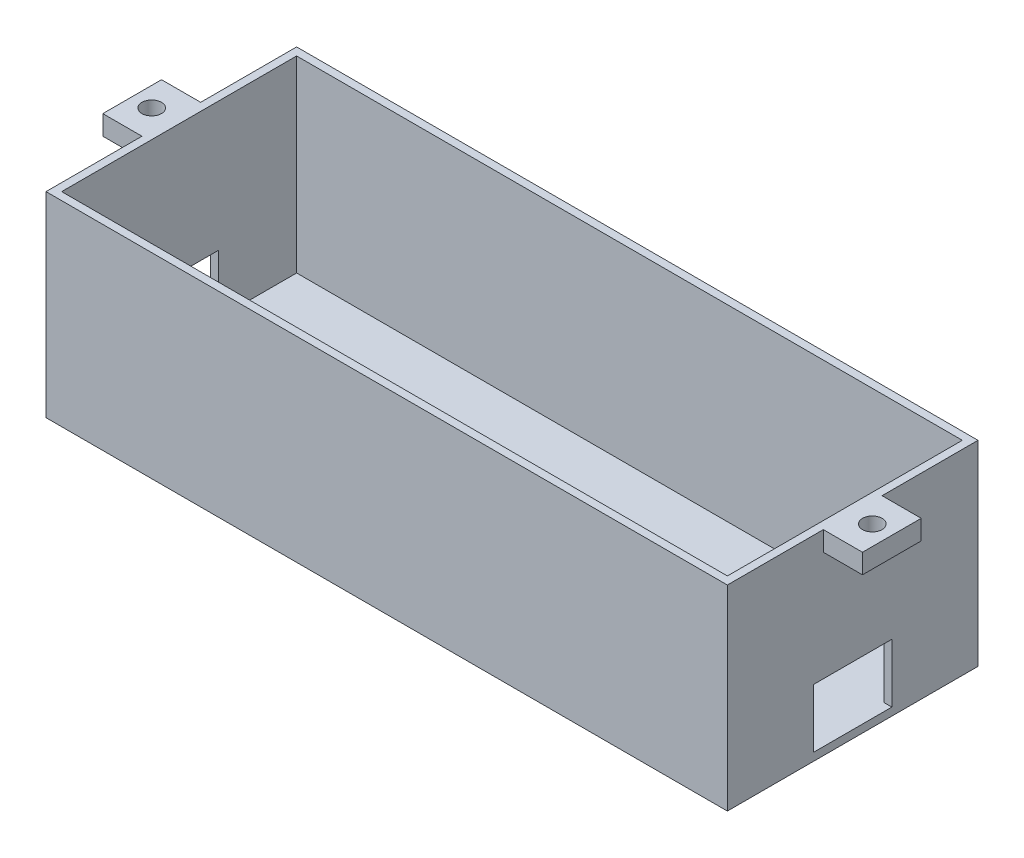
ISO-10303-21;
HEADER;
FILE_DESCRIPTION(('STEP AP214'),'2;1');
FILE_NAME('part.step','',(''),(''),'','','');
FILE_SCHEMA(('AUTOMOTIVE_DESIGN { 1 0 10303 214 1 1 1 1 }'));
ENDSEC;
DATA;
#1=APPLICATION_CONTEXT('core data for automotive mechanical design processes');
#2=APPLICATION_PROTOCOL_DEFINITION('international standard','automotive_design',2000,#1);
#3=PRODUCT_CONTEXT('',#1,'mechanical');
#4=PRODUCT('Part','Part','',(#3));
#5=PRODUCT_RELATED_PRODUCT_CATEGORY('part','',(#4));
#6=PRODUCT_DEFINITION_FORMATION('','',#4);
#7=PRODUCT_DEFINITION_CONTEXT('part definition',#1,'design');
#8=PRODUCT_DEFINITION('design','',#6,#7);
#9=PRODUCT_DEFINITION_SHAPE('','',#8);
#10=(LENGTH_UNIT() NAMED_UNIT(*) SI_UNIT(.MILLI.,.METRE.));
#11=(NAMED_UNIT(*) PLANE_ANGLE_UNIT() SI_UNIT($,.RADIAN.));
#12=(NAMED_UNIT(*) SI_UNIT($,.STERADIAN.) SOLID_ANGLE_UNIT());
#13=UNCERTAINTY_MEASURE_WITH_UNIT(LENGTH_MEASURE(1.E-05),#10,'distance_accuracy_value','');
#14=(GEOMETRIC_REPRESENTATION_CONTEXT(3) GLOBAL_UNCERTAINTY_ASSIGNED_CONTEXT((#13)) GLOBAL_UNIT_ASSIGNED_CONTEXT((#10,
#11,#12)) REPRESENTATION_CONTEXT('',''));
#15=CARTESIAN_POINT('',(0.,0.,0.));
#16=DIRECTION('',(0.,0.,1.));
#17=DIRECTION('',(1.,0.,0.));
#18=AXIS2_PLACEMENT_3D('',#15,#16,#17);
#19=CARTESIAN_POINT('',(87.,25.,32.));
#20=DIRECTION('',(-1.,0.,0.));
#21=DIRECTION('',(0.,0.,1.));
#22=AXIS2_PLACEMENT_3D('',#19,#20,#21);
#23=PLANE('',#22);
#24=DIRECTION('',(0.,0.,1.));
#25=VECTOR('',#24,1.);
#26=CARTESIAN_POINT('',(87.,-8.,-10.));
#27=LINE('',#26,#25);
#28=CARTESIAN_POINT('',(87.,-8.,-10.));
#29=VERTEX_POINT('',#28);
#30=CARTESIAN_POINT('',(87.,-8.,10.));
#31=VERTEX_POINT('',#30);
#32=EDGE_CURVE('E406',#29,#31,#27,.T.);
#33=ORIENTED_EDGE('',*,*,#32,.F.);
#34=DIRECTION('',(0.,1.,0.));
#35=VECTOR('',#34,1.);
#36=CARTESIAN_POINT('',(87.,-23.,-10.));
#37=LINE('',#36,#35);
#38=CARTESIAN_POINT('',(87.,-23.,-10.));
#39=VERTEX_POINT('',#38);
#40=EDGE_CURVE('E233',#39,#29,#37,.T.);
#41=ORIENTED_EDGE('',*,*,#40,.F.);
#42=DIRECTION('',(0.,0.,-1.));
#43=VECTOR('',#42,1.);
#44=CARTESIAN_POINT('',(87.,-23.,-10.));
#45=LINE('',#44,#43);
#46=CARTESIAN_POINT('',(87.,-23.,10.));
#47=VERTEX_POINT('',#46);
#48=EDGE_CURVE('E231',#47,#39,#45,.T.);
#49=ORIENTED_EDGE('',*,*,#48,.F.);
#50=DIRECTION('',(0.,-1.,0.));
#51=VECTOR('',#50,1.);
#52=CARTESIAN_POINT('',(87.,-23.,10.));
#53=LINE('',#52,#51);
#54=EDGE_CURVE('E224',#31,#47,#53,.T.);
#55=ORIENTED_EDGE('',*,*,#54,.F.);
#56=EDGE_LOOP('',(#33,#41,#49,#55));
#57=FACE_BOUND('',#56,.T.);
#58=DIRECTION('',(0.,1.,0.));
#59=VECTOR('',#58,1.);
#60=CARTESIAN_POINT('',(87.,20.,-7.5));
#61=LINE('',#60,#59);
#62=CARTESIAN_POINT('',(87.,20.,-7.5));
#63=VERTEX_POINT('',#62);
#64=CARTESIAN_POINT('',(87.,25.,-7.5));
#65=VERTEX_POINT('',#64);
#66=EDGE_CURVE('E259',#63,#65,#61,.T.);
#67=ORIENTED_EDGE('',*,*,#66,.F.);
#68=DIRECTION('',(0.,0.,-1.));
#69=VECTOR('',#68,1.);
#70=CARTESIAN_POINT('',(87.,20.,0.));
#71=LINE('',#70,#69);
#72=CARTESIAN_POINT('',(87.,20.,7.5));
#73=VERTEX_POINT('',#72);
#74=EDGE_CURVE('E248',#73,#63,#71,.T.);
#75=ORIENTED_EDGE('',*,*,#74,.F.);
#76=DIRECTION('',(0.,1.,0.));
#77=VECTOR('',#76,1.);
#78=CARTESIAN_POINT('',(87.,20.,7.5));
#79=LINE('',#78,#77);
#80=CARTESIAN_POINT('',(87.,25.,7.5));
#81=VERTEX_POINT('',#80);
#82=EDGE_CURVE('E276',#73,#81,#79,.T.);
#83=ORIENTED_EDGE('',*,*,#82,.T.);
#84=DIRECTION('',(0.,0.,-1.));
#85=VECTOR('',#84,1.);
#86=CARTESIAN_POINT('',(87.,25.,32.));
#87=LINE('',#86,#85);
#88=CARTESIAN_POINT('',(87.,25.,32.));
#89=VERTEX_POINT('',#88);
#90=EDGE_CURVE('E345',#89,#81,#87,.T.);
#91=ORIENTED_EDGE('',*,*,#90,.F.);
#92=DIRECTION('',(0.,-1.,0.));
#93=VECTOR('',#92,1.);
#94=CARTESIAN_POINT('',(87.,25.,32.));
#95=LINE('',#94,#93);
#96=CARTESIAN_POINT('',(87.,-25.,32.));
#97=VERTEX_POINT('',#96);
#98=EDGE_CURVE('E357',#89,#97,#95,.T.);
#99=ORIENTED_EDGE('',*,*,#98,.T.);
#100=DIRECTION('',(0.,0.,-1.));
#101=VECTOR('',#100,1.);
#102=CARTESIAN_POINT('',(87.,-25.,32.));
#103=LINE('',#102,#101);
#104=CARTESIAN_POINT('',(87.,-25.,-32.));
#105=VERTEX_POINT('',#104);
#106=EDGE_CURVE('E344',#97,#105,#103,.T.);
#107=ORIENTED_EDGE('',*,*,#106,.T.);
#108=DIRECTION('',(0.,-1.,0.));
#109=VECTOR('',#108,1.);
#110=CARTESIAN_POINT('',(87.,25.,-32.));
#111=LINE('',#110,#109);
#112=CARTESIAN_POINT('',(87.,25.,-32.));
#113=VERTEX_POINT('',#112);
#114=EDGE_CURVE('E374',#113,#105,#111,.T.);
#115=ORIENTED_EDGE('',*,*,#114,.F.);
#116=EDGE_CURVE('E349',#65,#113,#87,.T.);
#117=ORIENTED_EDGE('',*,*,#116,.F.);
#118=EDGE_LOOP('',(#67,#75,#83,#91,#99,#107,#115,#117));
#119=FACE_BOUND('',#118,.T.);
#120=ADVANCED_FACE('F35',(#57,#119),#23,.F.);
#121=CARTESIAN_POINT('',(-87.,25.,32.));
#122=DIRECTION('',(1.,0.,0.));
#123=DIRECTION('',(0.,0.,-1.));
#124=AXIS2_PLACEMENT_3D('',#121,#122,#123);
#125=PLANE('',#124);
#126=DIRECTION('',(0.,0.,1.));
#127=VECTOR('',#126,1.);
#128=CARTESIAN_POINT('',(-87.,-23.,-10.));
#129=LINE('',#128,#127);
#130=CARTESIAN_POINT('',(-87.,-23.,-10.));
#131=VERTEX_POINT('',#130);
#132=CARTESIAN_POINT('',(-87.,-23.,10.));
#133=VERTEX_POINT('',#132);
#134=EDGE_CURVE('E207',#131,#133,#129,.T.);
#135=ORIENTED_EDGE('',*,*,#134,.F.);
#136=DIRECTION('',(0.,-1.,0.));
#137=VECTOR('',#136,1.);
#138=CARTESIAN_POINT('',(-87.,-23.,-10.));
#139=LINE('',#138,#137);
#140=CARTESIAN_POINT('',(-87.,-8.,-10.));
#141=VERTEX_POINT('',#140);
#142=EDGE_CURVE('E57',#141,#131,#139,.T.);
#143=ORIENTED_EDGE('',*,*,#142,.F.);
#144=DIRECTION('',(0.,0.,-1.));
#145=VECTOR('',#144,1.);
#146=CARTESIAN_POINT('',(-87.,-8.,-10.));
#147=LINE('',#146,#145);
#148=CARTESIAN_POINT('',(-87.,-8.,10.));
#149=VERTEX_POINT('',#148);
#150=EDGE_CURVE('E216',#149,#141,#147,.T.);
#151=ORIENTED_EDGE('',*,*,#150,.F.);
#152=DIRECTION('',(0.,1.,0.));
#153=VECTOR('',#152,1.);
#154=CARTESIAN_POINT('',(-87.,-23.,10.));
#155=LINE('',#154,#153);
#156=EDGE_CURVE('E199',#133,#149,#155,.T.);
#157=ORIENTED_EDGE('',*,*,#156,.F.);
#158=EDGE_LOOP('',(#135,#143,#151,#157));
#159=FACE_BOUND('',#158,.T.);
#160=DIRECTION('',(0.,1.,0.));
#161=VECTOR('',#160,1.);
#162=CARTESIAN_POINT('',(-87.,20.,7.5));
#163=LINE('',#162,#161);
#164=CARTESIAN_POINT('',(-87.,20.,7.5));
#165=VERTEX_POINT('',#164);
#166=CARTESIAN_POINT('',(-87.,25.,7.5));
#167=VERTEX_POINT('',#166);
#168=EDGE_CURVE('E310',#165,#167,#163,.T.);
#169=ORIENTED_EDGE('',*,*,#168,.F.);
#170=DIRECTION('',(0.,0.,1.));
#171=VECTOR('',#170,1.);
#172=CARTESIAN_POINT('',(-87.,20.,0.));
#173=LINE('',#172,#171);
#174=CARTESIAN_POINT('',(-87.,20.,-7.5));
#175=VERTEX_POINT('',#174);
#176=EDGE_CURVE('E292',#175,#165,#173,.T.);
#177=ORIENTED_EDGE('',*,*,#176,.F.);
#178=DIRECTION('',(0.,1.,0.));
#179=VECTOR('',#178,1.);
#180=CARTESIAN_POINT('',(-87.,20.,-7.5));
#181=LINE('',#180,#179);
#182=CARTESIAN_POINT('',(-87.,25.,-7.5));
#183=VERTEX_POINT('',#182);
#184=EDGE_CURVE('E306',#175,#183,#181,.T.);
#185=ORIENTED_EDGE('',*,*,#184,.T.);
#186=DIRECTION('',(0.,0.,1.));
#187=VECTOR('',#186,1.);
#188=CARTESIAN_POINT('',(-87.,25.,32.));
#189=LINE('',#188,#187);
#190=CARTESIAN_POINT('',(-87.,25.,-32.));
#191=VERTEX_POINT('',#190);
#192=EDGE_CURVE('E352',#191,#183,#189,.T.);
#193=ORIENTED_EDGE('',*,*,#192,.F.);
#194=DIRECTION('',(0.,-1.,0.));
#195=VECTOR('',#194,1.);
#196=CARTESIAN_POINT('',(-87.,25.,-32.));
#197=LINE('',#196,#195);
#198=CARTESIAN_POINT('',(-87.,-25.,-32.));
#199=VERTEX_POINT('',#198);
#200=EDGE_CURVE('E372',#191,#199,#197,.T.);
#201=ORIENTED_EDGE('',*,*,#200,.T.);
#202=DIRECTION('',(0.,0.,1.));
#203=VECTOR('',#202,1.);
#204=CARTESIAN_POINT('',(-87.,-25.,32.));
#205=LINE('',#204,#203);
#206=CARTESIAN_POINT('',(-87.,-25.,32.));
#207=VERTEX_POINT('',#206);
#208=EDGE_CURVE('E363',#199,#207,#205,.T.);
#209=ORIENTED_EDGE('',*,*,#208,.T.);
#210=DIRECTION('',(0.,-1.,0.));
#211=VECTOR('',#210,1.);
#212=CARTESIAN_POINT('',(-87.,25.,32.));
#213=LINE('',#212,#211);
#214=CARTESIAN_POINT('',(-87.,25.,32.));
#215=VERTEX_POINT('',#214);
#216=EDGE_CURVE('E370',#215,#207,#213,.T.);
#217=ORIENTED_EDGE('',*,*,#216,.F.);
#218=EDGE_CURVE('E351',#167,#215,#189,.T.);
#219=ORIENTED_EDGE('',*,*,#218,.F.);
#220=EDGE_LOOP('',(#169,#177,#185,#193,#201,#209,#217,#219));
#221=FACE_BOUND('',#220,.T.);
#222=ADVANCED_FACE('F213',(#159,#221),#125,.F.);
#223=CARTESIAN_POINT('',(0.,25.,0.));
#224=DIRECTION('',(0.,-1.,0.));
#225=DIRECTION('',(0.,0.,-1.));
#226=AXIS2_PLACEMENT_3D('',#223,#224,#225);
#227=PLANE('',#226);
#228=ORIENTED_EDGE('',*,*,#90,.T.);
#229=DIRECTION('',(1.,0.,0.));
#230=VECTOR('',#229,1.);
#231=CARTESIAN_POINT('',(0.,25.,7.5));
#232=LINE('',#231,#230);
#233=CARTESIAN_POINT('',(97.,25.,7.5));
#234=VERTEX_POINT('',#233);
#235=EDGE_CURVE('E262',#81,#234,#232,.T.);
#236=ORIENTED_EDGE('',*,*,#235,.T.);
#237=DIRECTION('',(0.,0.,1.));
#238=VECTOR('',#237,1.);
#239=CARTESIAN_POINT('',(97.,25.,0.));
#240=LINE('',#239,#238);
#241=CARTESIAN_POINT('',(97.,25.,-7.5));
#242=VERTEX_POINT('',#241);
#243=EDGE_CURVE('E265',#242,#234,#240,.T.);
#244=ORIENTED_EDGE('',*,*,#243,.F.);
#245=DIRECTION('',(1.,0.,0.));
#246=VECTOR('',#245,1.);
#247=CARTESIAN_POINT('',(0.,25.,-7.5));
#248=LINE('',#247,#246);
#249=EDGE_CURVE('E244',#65,#242,#248,.T.);
#250=ORIENTED_EDGE('',*,*,#249,.F.);
#251=ORIENTED_EDGE('',*,*,#116,.T.);
#252=DIRECTION('',(-1.,0.,0.));
#253=VECTOR('',#252,1.);
#254=CARTESIAN_POINT('',(-87.,25.,-32.));
#255=LINE('',#254,#253);
#256=EDGE_CURVE('E348',#113,#191,#255,.T.);
#257=ORIENTED_EDGE('',*,*,#256,.T.);
#258=ORIENTED_EDGE('',*,*,#192,.T.);
#259=DIRECTION('',(-1.,0.,0.));
#260=VECTOR('',#259,1.);
#261=CARTESIAN_POINT('',(0.,25.,-7.5));
#262=LINE('',#261,#260);
#263=CARTESIAN_POINT('',(-97.,25.,-7.5));
#264=VERTEX_POINT('',#263);
#265=EDGE_CURVE('E298',#183,#264,#262,.T.);
#266=ORIENTED_EDGE('',*,*,#265,.T.);
#267=DIRECTION('',(0.,0.,1.));
#268=VECTOR('',#267,1.);
#269=CARTESIAN_POINT('',(-97.,25.,0.));
#270=LINE('',#269,#268);
#271=CARTESIAN_POINT('',(-97.,25.,7.5));
#272=VERTEX_POINT('',#271);
#273=EDGE_CURVE('E301',#264,#272,#270,.T.);
#274=ORIENTED_EDGE('',*,*,#273,.T.);
#275=DIRECTION('',(-1.,0.,0.));
#276=VECTOR('',#275,1.);
#277=CARTESIAN_POINT('',(0.,25.,7.5));
#278=LINE('',#277,#276);
#279=EDGE_CURVE('E284',#167,#272,#278,.T.);
#280=ORIENTED_EDGE('',*,*,#279,.F.);
#281=ORIENTED_EDGE('',*,*,#218,.T.);
#282=DIRECTION('',(1.,0.,0.));
#283=VECTOR('',#282,1.);
#284=CARTESIAN_POINT('',(-87.,25.,32.));
#285=LINE('',#284,#283);
#286=EDGE_CURVE('E355',#215,#89,#285,.T.);
#287=ORIENTED_EDGE('',*,*,#286,.T.);
#288=EDGE_LOOP('',(#228,#236,#244,#250,#251,#257,#258,#266,#274,#280,#281,#287));
#289=FACE_BOUND('',#288,.T.);
#290=DIRECTION('',(0.,0.,-1.));
#291=VECTOR('',#290,1.);
#292=CARTESIAN_POINT('',(85.,25.,30.));
#293=LINE('',#292,#291);
#294=CARTESIAN_POINT('',(85.,25.,30.));
#295=VERTEX_POINT('',#294);
#296=CARTESIAN_POINT('',(85.,25.,-30.));
#297=VERTEX_POINT('',#296);
#298=EDGE_CURVE('E324',#295,#297,#293,.T.);
#299=ORIENTED_EDGE('',*,*,#298,.F.);
#300=DIRECTION('',(1.,0.,0.));
#301=VECTOR('',#300,1.);
#302=CARTESIAN_POINT('',(-85.,25.,30.));
#303=LINE('',#302,#301);
#304=CARTESIAN_POINT('',(-85.,25.,30.));
#305=VERTEX_POINT('',#304);
#306=EDGE_CURVE('E331',#305,#295,#303,.T.);
#307=ORIENTED_EDGE('',*,*,#306,.F.);
#308=DIRECTION('',(0.,0.,1.));
#309=VECTOR('',#308,1.);
#310=CARTESIAN_POINT('',(-85.,25.,30.));
#311=LINE('',#310,#309);
#312=CARTESIAN_POINT('',(-85.,25.,-30.));
#313=VERTEX_POINT('',#312);
#314=EDGE_CURVE('E328',#313,#305,#311,.T.);
#315=ORIENTED_EDGE('',*,*,#314,.F.);
#316=DIRECTION('',(-1.,0.,0.));
#317=VECTOR('',#316,1.);
#318=CARTESIAN_POINT('',(-85.,25.,-30.));
#319=LINE('',#318,#317);
#320=EDGE_CURVE('E326',#297,#313,#319,.T.);
#321=ORIENTED_EDGE('',*,*,#320,.F.);
#322=EDGE_LOOP('',(#299,#307,#315,#321));
#323=FACE_BOUND('',#322,.T.);
#324=CARTESIAN_POINT('',(-92.,25.,0.));
#325=DIRECTION('',(0.,1.,0.));
#326=DIRECTION('',(0.,0.,1.));
#327=AXIS2_PLACEMENT_3D('',#324,#325,#326);
#328=CIRCLE('',#327,2.5);
#329=CARTESIAN_POINT('',(-92.,25.,2.5));
#330=VERTEX_POINT('',#329);
#331=EDGE_CURVE('E273',#330,#330,#328,.T.);
#332=ORIENTED_EDGE('',*,*,#331,.F.);
#333=EDGE_LOOP('',(#332));
#334=FACE_BOUND('',#333,.T.);
#335=CARTESIAN_POINT('',(92.,25.,0.));
#336=DIRECTION('',(0.,1.,0.));
#337=DIRECTION('',(0.,0.,1.));
#338=AXIS2_PLACEMENT_3D('',#335,#336,#337);
#339=CIRCLE('',#338,2.5);
#340=CARTESIAN_POINT('',(92.,25.,2.5));
#341=VERTEX_POINT('',#340);
#342=EDGE_CURVE('E249',#341,#341,#339,.F.);
#343=ORIENTED_EDGE('',*,*,#342,.T.);
#344=EDGE_LOOP('',(#343));
#345=FACE_BOUND('',#344,.T.);
#346=ADVANCED_FACE('F390',(#289,#323,#334,#345),#227,.F.);
#347=CARTESIAN_POINT('',(0.,-25.,0.));
#348=DIRECTION('',(0.,-1.,0.));
#349=DIRECTION('',(0.,0.,-1.));
#350=AXIS2_PLACEMENT_3D('',#347,#348,#349);
#351=PLANE('',#350);
#352=CARTESIAN_POINT('',(-41.5,-25.,-14.));
#353=DIRECTION('',(0.,-1.,0.));
#354=DIRECTION('',(0.,0.,-1.));
#355=AXIS2_PLACEMENT_3D('',#352,#353,#354);
#356=CIRCLE('',#355,1.25);
#357=CARTESIAN_POINT('',(-41.5,-25.,-15.25));
#358=VERTEX_POINT('',#357);
#359=EDGE_CURVE('E415',#358,#358,#356,.F.);
#360=ORIENTED_EDGE('',*,*,#359,.T.);
#361=EDGE_LOOP('',(#360));
#362=FACE_BOUND('',#361,.T.);
#363=CARTESIAN_POINT('',(-41.5,-25.,14.));
#364=DIRECTION('',(0.,-1.,0.));
#365=DIRECTION('',(0.,0.,-1.));
#366=AXIS2_PLACEMENT_3D('',#363,#364,#365);
#367=CIRCLE('',#366,1.25);
#368=CARTESIAN_POINT('',(-41.5,-25.,12.75));
#369=VERTEX_POINT('',#368);
#370=EDGE_CURVE('E420',#369,#369,#367,.F.);
#371=ORIENTED_EDGE('',*,*,#370,.T.);
#372=EDGE_LOOP('',(#371));
#373=FACE_BOUND('',#372,.T.);
#374=CARTESIAN_POINT('',(0.,-25.,0.));
#375=DIRECTION('',(0.,-1.,0.));
#376=DIRECTION('',(0.,0.,-1.));
#377=AXIS2_PLACEMENT_3D('',#374,#375,#376);
#378=CIRCLE('',#377,2.5);
#379=CARTESIAN_POINT('',(0.,-25.,-2.5));
#380=VERTEX_POINT('',#379);
#381=EDGE_CURVE('E428',#380,#380,#378,.F.);
#382=ORIENTED_EDGE('',*,*,#381,.T.);
#383=EDGE_LOOP('',(#382));
#384=FACE_BOUND('',#383,.T.);
#385=ORIENTED_EDGE('',*,*,#106,.F.);
#386=DIRECTION('',(1.,0.,0.));
#387=VECTOR('',#386,1.);
#388=CARTESIAN_POINT('',(-87.,-25.,32.));
#389=LINE('',#388,#387);
#390=EDGE_CURVE('E366',#207,#97,#389,.T.);
#391=ORIENTED_EDGE('',*,*,#390,.F.);
#392=ORIENTED_EDGE('',*,*,#208,.F.);
#393=DIRECTION('',(-1.,0.,0.));
#394=VECTOR('',#393,1.);
#395=CARTESIAN_POINT('',(-87.,-25.,-32.));
#396=LINE('',#395,#394);
#397=EDGE_CURVE('E360',#105,#199,#396,.T.);
#398=ORIENTED_EDGE('',*,*,#397,.F.);
#399=EDGE_LOOP('',(#385,#391,#392,#398));
#400=FACE_BOUND('',#399,.T.);
#401=ADVANCED_FACE('F487',(#362,#373,#384,#400),#351,.T.);
#402=CARTESIAN_POINT('',(-87.,25.,-32.));
#403=DIRECTION('',(0.,0.,1.));
#404=DIRECTION('',(1.,0.,0.));
#405=AXIS2_PLACEMENT_3D('',#402,#403,#404);
#406=PLANE('',#405);
#407=ORIENTED_EDGE('',*,*,#114,.T.);
#408=ORIENTED_EDGE('',*,*,#397,.T.);
#409=ORIENTED_EDGE('',*,*,#200,.F.);
#410=ORIENTED_EDGE('',*,*,#256,.F.);
#411=EDGE_LOOP('',(#407,#408,#409,#410));
#412=FACE_BOUND('',#411,.T.);
#413=ADVANCED_FACE('F491',(#412),#406,.F.);
#414=CARTESIAN_POINT('',(-87.,25.,32.));
#415=DIRECTION('',(0.,0.,-1.));
#416=DIRECTION('',(-1.,0.,0.));
#417=AXIS2_PLACEMENT_3D('',#414,#415,#416);
#418=PLANE('',#417);
#419=ORIENTED_EDGE('',*,*,#216,.T.);
#420=ORIENTED_EDGE('',*,*,#390,.T.);
#421=ORIENTED_EDGE('',*,*,#98,.F.);
#422=ORIENTED_EDGE('',*,*,#286,.F.);
#423=EDGE_LOOP('',(#419,#420,#421,#422));
#424=FACE_BOUND('',#423,.T.);
#425=ADVANCED_FACE('F482',(#424),#418,.F.);
#426=CARTESIAN_POINT('',(85.,25.,30.));
#427=DIRECTION('',(-1.,0.,0.));
#428=DIRECTION('',(0.,0.,1.));
#429=AXIS2_PLACEMENT_3D('',#426,#427,#428);
#430=PLANE('',#429);
#431=DIRECTION('',(0.,-1.,0.));
#432=VECTOR('',#431,1.);
#433=CARTESIAN_POINT('',(85.,25.,-10.));
#434=LINE('',#433,#432);
#435=CARTESIAN_POINT('',(85.,-8.,-10.));
#436=VERTEX_POINT('',#435);
#437=CARTESIAN_POINT('',(85.,-23.,-10.));
#438=VERTEX_POINT('',#437);
#439=EDGE_CURVE('E239',#436,#438,#434,.T.);
#440=ORIENTED_EDGE('',*,*,#439,.F.);
#441=DIRECTION('',(0.,0.,-1.));
#442=VECTOR('',#441,1.);
#443=CARTESIAN_POINT('',(85.,-8.,30.));
#444=LINE('',#443,#442);
#445=CARTESIAN_POINT('',(85.,-8.,10.));
#446=VERTEX_POINT('',#445);
#447=EDGE_CURVE('E242',#446,#436,#444,.T.);
#448=ORIENTED_EDGE('',*,*,#447,.F.);
#449=DIRECTION('',(0.,1.,0.));
#450=VECTOR('',#449,1.);
#451=CARTESIAN_POINT('',(85.,25.,9.99999999999998));
#452=LINE('',#451,#450);
#453=CARTESIAN_POINT('',(85.,-23.,10.));
#454=VERTEX_POINT('',#453);
#455=EDGE_CURVE('E235',#454,#446,#452,.T.);
#456=ORIENTED_EDGE('',*,*,#455,.F.);
#457=DIRECTION('',(0.,0.,-1.));
#458=VECTOR('',#457,1.);
#459=CARTESIAN_POINT('',(85.,-23.,30.));
#460=LINE('',#459,#458);
#461=CARTESIAN_POINT('',(85.,-23.,30.));
#462=VERTEX_POINT('',#461);
#463=EDGE_CURVE('E322',#462,#454,#460,.T.);
#464=ORIENTED_EDGE('',*,*,#463,.F.);
#465=DIRECTION('',(0.,-1.,0.));
#466=VECTOR('',#465,1.);
#467=CARTESIAN_POINT('',(85.,25.,30.));
#468=LINE('',#467,#466);
#469=EDGE_CURVE('E333',#295,#462,#468,.T.);
#470=ORIENTED_EDGE('',*,*,#469,.F.);
#471=ORIENTED_EDGE('',*,*,#298,.T.);
#472=DIRECTION('',(0.,-1.,0.));
#473=VECTOR('',#472,1.);
#474=CARTESIAN_POINT('',(85.,25.,-30.));
#475=LINE('',#474,#473);
#476=CARTESIAN_POINT('',(85.,-23.,-30.));
#477=VERTEX_POINT('',#476);
#478=EDGE_CURVE('E341',#297,#477,#475,.T.);
#479=ORIENTED_EDGE('',*,*,#478,.T.);
#480=EDGE_CURVE('E321',#438,#477,#460,.T.);
#481=ORIENTED_EDGE('',*,*,#480,.F.);
#482=EDGE_LOOP('',(#440,#448,#456,#464,#470,#471,#479,#481));
#483=FACE_BOUND('',#482,.T.);
#484=ADVANCED_FACE('F394',(#483),#430,.T.);
#485=CARTESIAN_POINT('',(-85.,25.,-30.));
#486=DIRECTION('',(0.,0.,1.));
#487=DIRECTION('',(1.,0.,0.));
#488=AXIS2_PLACEMENT_3D('',#485,#486,#487);
#489=PLANE('',#488);
#490=DIRECTION('',(-1.,0.,0.));
#491=VECTOR('',#490,1.);
#492=CARTESIAN_POINT('',(-85.,-23.,-30.));
#493=LINE('',#492,#491);
#494=CARTESIAN_POINT('',(-85.,-23.,-30.));
#495=VERTEX_POINT('',#494);
#496=EDGE_CURVE('E318',#477,#495,#493,.T.);
#497=ORIENTED_EDGE('',*,*,#496,.F.);
#498=ORIENTED_EDGE('',*,*,#478,.F.);
#499=ORIENTED_EDGE('',*,*,#320,.T.);
#500=DIRECTION('',(0.,-1.,0.));
#501=VECTOR('',#500,1.);
#502=CARTESIAN_POINT('',(-85.,25.,-30.));
#503=LINE('',#502,#501);
#504=EDGE_CURVE('E338',#313,#495,#503,.T.);
#505=ORIENTED_EDGE('',*,*,#504,.T.);
#506=EDGE_LOOP('',(#497,#498,#499,#505));
#507=FACE_BOUND('',#506,.T.);
#508=ADVANCED_FACE('F584',(#507),#489,.T.);
#509=CARTESIAN_POINT('',(-85.,25.,30.));
#510=DIRECTION('',(1.,0.,0.));
#511=DIRECTION('',(0.,0.,-1.));
#512=AXIS2_PLACEMENT_3D('',#509,#510,#511);
#513=PLANE('',#512);
#514=DIRECTION('',(0.,1.,0.));
#515=VECTOR('',#514,1.);
#516=CARTESIAN_POINT('',(-85.,25.,-10.));
#517=LINE('',#516,#515);
#518=CARTESIAN_POINT('',(-85.,-23.,-10.));
#519=VERTEX_POINT('',#518);
#520=CARTESIAN_POINT('',(-85.,-8.,-10.));
#521=VERTEX_POINT('',#520);
#522=EDGE_CURVE('E237',#519,#521,#517,.T.);
#523=ORIENTED_EDGE('',*,*,#522,.F.);
#524=DIRECTION('',(0.,0.,1.));
#525=VECTOR('',#524,1.);
#526=CARTESIAN_POINT('',(-85.,-23.,30.));
#527=LINE('',#526,#525);
#528=EDGE_CURVE('E316',#495,#519,#527,.T.);
#529=ORIENTED_EDGE('',*,*,#528,.F.);
#530=ORIENTED_EDGE('',*,*,#504,.F.);
#531=ORIENTED_EDGE('',*,*,#314,.T.);
#532=DIRECTION('',(0.,-1.,0.));
#533=VECTOR('',#532,1.);
#534=CARTESIAN_POINT('',(-85.,25.,30.));
#535=LINE('',#534,#533);
#536=CARTESIAN_POINT('',(-85.,-23.,30.));
#537=VERTEX_POINT('',#536);
#538=EDGE_CURVE('E335',#305,#537,#535,.T.);
#539=ORIENTED_EDGE('',*,*,#538,.T.);
#540=CARTESIAN_POINT('',(-85.,-23.,10.));
#541=VERTEX_POINT('',#540);
#542=EDGE_CURVE('E309',#541,#537,#527,.T.);
#543=ORIENTED_EDGE('',*,*,#542,.F.);
#544=DIRECTION('',(0.,-1.,0.));
#545=VECTOR('',#544,1.);
#546=CARTESIAN_POINT('',(-85.,25.,9.99999999999998));
#547=LINE('',#546,#545);
#548=CARTESIAN_POINT('',(-85.,-8.,10.));
#549=VERTEX_POINT('',#548);
#550=EDGE_CURVE('E202',#549,#541,#547,.T.);
#551=ORIENTED_EDGE('',*,*,#550,.F.);
#552=DIRECTION('',(0.,0.,1.));
#553=VECTOR('',#552,1.);
#554=CARTESIAN_POINT('',(-85.,-8.,30.));
#555=LINE('',#554,#553);
#556=EDGE_CURVE('E11',#521,#549,#555,.T.);
#557=ORIENTED_EDGE('',*,*,#556,.F.);
#558=EDGE_LOOP('',(#523,#529,#530,#531,#539,#543,#551,#557));
#559=FACE_BOUND('',#558,.T.);
#560=ADVANCED_FACE('F383',(#559),#513,.T.);
#561=CARTESIAN_POINT('',(-85.,25.,30.));
#562=DIRECTION('',(0.,0.,-1.));
#563=DIRECTION('',(-1.,0.,0.));
#564=AXIS2_PLACEMENT_3D('',#561,#562,#563);
#565=PLANE('',#564);
#566=DIRECTION('',(1.,0.,0.));
#567=VECTOR('',#566,1.);
#568=CARTESIAN_POINT('',(-85.,-23.,30.));
#569=LINE('',#568,#567);
#570=EDGE_CURVE('E42',#537,#462,#569,.T.);
#571=ORIENTED_EDGE('',*,*,#570,.F.);
#572=ORIENTED_EDGE('',*,*,#538,.F.);
#573=ORIENTED_EDGE('',*,*,#306,.T.);
#574=ORIENTED_EDGE('',*,*,#469,.T.);
#575=EDGE_LOOP('',(#571,#572,#573,#574));
#576=FACE_BOUND('',#575,.T.);
#577=ADVANCED_FACE('F379',(#576),#565,.T.);
#578=CARTESIAN_POINT('',(87.,-23.,206.01149387325));
#579=DIRECTION('',(0.,1.,0.));
#580=DIRECTION('',(0.,0.,1.));
#581=AXIS2_PLACEMENT_3D('',#578,#579,#580);
#582=PLANE('',#581);
#583=CARTESIAN_POINT('',(-41.5,-23.,-14.));
#584=DIRECTION('',(0.,1.,0.));
#585=DIRECTION('',(0.,0.,1.));
#586=AXIS2_PLACEMENT_3D('',#583,#584,#585);
#587=CIRCLE('',#586,1.25);
#588=CARTESIAN_POINT('',(-41.5,-23.,-12.75));
#589=VERTEX_POINT('',#588);
#590=EDGE_CURVE('E413',#589,#589,#587,.T.);
#591=ORIENTED_EDGE('',*,*,#590,.F.);
#592=EDGE_LOOP('',(#591));
#593=FACE_BOUND('',#592,.T.);
#594=CARTESIAN_POINT('',(-41.5,-23.,14.));
#595=DIRECTION('',(0.,1.,0.));
#596=DIRECTION('',(0.,0.,1.));
#597=AXIS2_PLACEMENT_3D('',#594,#595,#596);
#598=CIRCLE('',#597,1.25);
#599=CARTESIAN_POINT('',(-41.5,-23.,15.25));
#600=VERTEX_POINT('',#599);
#601=EDGE_CURVE('E425',#600,#600,#598,.T.);
#602=ORIENTED_EDGE('',*,*,#601,.F.);
#603=EDGE_LOOP('',(#602));
#604=FACE_BOUND('',#603,.T.);
#605=CARTESIAN_POINT('',(0.,-23.,0.));
#606=DIRECTION('',(0.,1.,0.));
#607=DIRECTION('',(0.,0.,1.));
#608=AXIS2_PLACEMENT_3D('',#605,#606,#607);
#609=CIRCLE('',#608,2.5);
#610=CARTESIAN_POINT('',(0.,-23.,2.5));
#611=VERTEX_POINT('',#610);
#612=EDGE_CURVE('E430',#611,#611,#609,.T.);
#613=ORIENTED_EDGE('',*,*,#612,.F.);
#614=EDGE_LOOP('',(#613));
#615=FACE_BOUND('',#614,.T.);
#616=ORIENTED_EDGE('',*,*,#463,.T.);
#617=DIRECTION('',(-1.,0.,0.));
#618=VECTOR('',#617,1.);
#619=CARTESIAN_POINT('',(112.,-23.,10.));
#620=LINE('',#619,#618);
#621=EDGE_CURVE('E49',#47,#454,#620,.T.);
#622=ORIENTED_EDGE('',*,*,#621,.F.);
#623=ORIENTED_EDGE('',*,*,#48,.T.);
#624=DIRECTION('',(-1.,0.,0.));
#625=VECTOR('',#624,1.);
#626=CARTESIAN_POINT('',(112.,-23.,-10.));
#627=LINE('',#626,#625);
#628=EDGE_CURVE('E204',#39,#438,#627,.T.);
#629=ORIENTED_EDGE('',*,*,#628,.T.);
#630=ORIENTED_EDGE('',*,*,#480,.T.);
#631=ORIENTED_EDGE('',*,*,#496,.T.);
#632=ORIENTED_EDGE('',*,*,#528,.T.);
#633=EDGE_CURVE('E210',#519,#131,#627,.T.);
#634=ORIENTED_EDGE('',*,*,#633,.T.);
#635=ORIENTED_EDGE('',*,*,#134,.T.);
#636=EDGE_CURVE('E194',#541,#133,#620,.T.);
#637=ORIENTED_EDGE('',*,*,#636,.F.);
#638=ORIENTED_EDGE('',*,*,#542,.T.);
#639=ORIENTED_EDGE('',*,*,#570,.T.);
#640=EDGE_LOOP('',(#616,#622,#623,#629,#630,#631,#632,#634,#635,#637,#638,#639));
#641=FACE_BOUND('',#640,.T.);
#642=ADVANCED_FACE('F208',(#593,#604,#615,#641),#582,.T.);
#643=CARTESIAN_POINT('',(0.,20.,-7.5));
#644=DIRECTION('',(0.,0.,-1.));
#645=DIRECTION('',(-1.,0.,0.));
#646=AXIS2_PLACEMENT_3D('',#643,#644,#645);
#647=PLANE('',#646);
#648=ORIENTED_EDGE('',*,*,#265,.F.);
#649=ORIENTED_EDGE('',*,*,#184,.F.);
#650=DIRECTION('',(-1.,0.,0.));
#651=VECTOR('',#650,1.);
#652=CARTESIAN_POINT('',(0.,20.,-7.5));
#653=LINE('',#652,#651);
#654=CARTESIAN_POINT('',(-97.,20.,-7.5));
#655=VERTEX_POINT('',#654);
#656=EDGE_CURVE('E283',#175,#655,#653,.T.);
#657=ORIENTED_EDGE('',*,*,#656,.T.);
#658=DIRECTION('',(0.,1.,0.));
#659=VECTOR('',#658,1.);
#660=CARTESIAN_POINT('',(-97.,20.,-7.5));
#661=LINE('',#660,#659);
#662=EDGE_CURVE('E295',#655,#264,#661,.T.);
#663=ORIENTED_EDGE('',*,*,#662,.T.);
#664=EDGE_LOOP('',(#648,#649,#657,#663));
#665=FACE_BOUND('',#664,.T.);
#666=ADVANCED_FACE('F437',(#665),#647,.T.);
#667=CARTESIAN_POINT('',(0.,20.,7.5));
#668=DIRECTION('',(0.,0.,-1.));
#669=DIRECTION('',(-1.,0.,0.));
#670=AXIS2_PLACEMENT_3D('',#667,#668,#669);
#671=PLANE('',#670);
#672=ORIENTED_EDGE('',*,*,#279,.T.);
#673=DIRECTION('',(0.,1.,0.));
#674=VECTOR('',#673,1.);
#675=CARTESIAN_POINT('',(-97.,20.,7.5));
#676=LINE('',#675,#674);
#677=CARTESIAN_POINT('',(-97.,20.,7.5));
#678=VERTEX_POINT('',#677);
#679=EDGE_CURVE('E313',#678,#272,#676,.T.);
#680=ORIENTED_EDGE('',*,*,#679,.F.);
#681=DIRECTION('',(-1.,0.,0.));
#682=VECTOR('',#681,1.);
#683=CARTESIAN_POINT('',(0.,20.,7.5));
#684=LINE('',#683,#682);
#685=EDGE_CURVE('E290',#165,#678,#684,.T.);
#686=ORIENTED_EDGE('',*,*,#685,.F.);
#687=ORIENTED_EDGE('',*,*,#168,.T.);
#688=EDGE_LOOP('',(#672,#680,#686,#687));
#689=FACE_BOUND('',#688,.T.);
#690=ADVANCED_FACE('F444',(#689),#671,.F.);
#691=CARTESIAN_POINT('',(-92.,20.,0.));
#692=DIRECTION('',(0.,1.,0.));
#693=DIRECTION('',(0.,0.,1.));
#694=AXIS2_PLACEMENT_3D('',#691,#692,#693);
#695=CYLINDRICAL_SURFACE('',#694,2.5);
#696=CARTESIAN_POINT('',(-92.,20.,0.));
#697=DIRECTION('',(0.,1.,0.));
#698=DIRECTION('',(0.,0.,1.));
#699=AXIS2_PLACEMENT_3D('',#696,#697,#698);
#700=CIRCLE('',#699,2.5);
#701=CARTESIAN_POINT('',(-92.,20.,2.5));
#702=VERTEX_POINT('',#701);
#703=EDGE_CURVE('E280',#702,#702,#700,.T.);
#704=ORIENTED_EDGE('',*,*,#703,.F.);
#705=EDGE_LOOP('',(#704));
#706=FACE_BOUND('',#705,.T.);
#707=ORIENTED_EDGE('',*,*,#331,.T.);
#708=EDGE_LOOP('',(#707));
#709=FACE_BOUND('',#708,.T.);
#710=ADVANCED_FACE('F505',(#706,#709),#695,.F.);
#711=CARTESIAN_POINT('',(-97.,20.,0.));
#712=DIRECTION('',(-1.,0.,0.));
#713=DIRECTION('',(0.,0.,1.));
#714=AXIS2_PLACEMENT_3D('',#711,#712,#713);
#715=PLANE('',#714);
#716=ORIENTED_EDGE('',*,*,#273,.F.);
#717=ORIENTED_EDGE('',*,*,#662,.F.);
#718=DIRECTION('',(0.,0.,1.));
#719=VECTOR('',#718,1.);
#720=CARTESIAN_POINT('',(-97.,20.,0.));
#721=LINE('',#720,#719);
#722=EDGE_CURVE('E287',#655,#678,#721,.T.);
#723=ORIENTED_EDGE('',*,*,#722,.T.);
#724=ORIENTED_EDGE('',*,*,#679,.T.);
#725=EDGE_LOOP('',(#716,#717,#723,#724));
#726=FACE_BOUND('',#725,.T.);
#727=ADVANCED_FACE('F502',(#726),#715,.T.);
#728=CARTESIAN_POINT('',(0.,20.,0.));
#729=DIRECTION('',(0.,1.,0.));
#730=DIRECTION('',(0.,0.,1.));
#731=AXIS2_PLACEMENT_3D('',#728,#729,#730);
#732=PLANE('',#731);
#733=ORIENTED_EDGE('',*,*,#703,.T.);
#734=EDGE_LOOP('',(#733));
#735=FACE_BOUND('',#734,.T.);
#736=ORIENTED_EDGE('',*,*,#656,.F.);
#737=ORIENTED_EDGE('',*,*,#176,.T.);
#738=ORIENTED_EDGE('',*,*,#685,.T.);
#739=ORIENTED_EDGE('',*,*,#722,.F.);
#740=EDGE_LOOP('',(#736,#737,#738,#739));
#741=FACE_BOUND('',#740,.T.);
#742=ADVANCED_FACE('F498',(#735,#741),#732,.F.);
#743=CARTESIAN_POINT('',(0.,20.,-7.5));
#744=DIRECTION('',(0.,0.,1.));
#745=DIRECTION('',(1.,0.,0.));
#746=AXIS2_PLACEMENT_3D('',#743,#744,#745);
#747=PLANE('',#746);
#748=ORIENTED_EDGE('',*,*,#249,.T.);
#749=DIRECTION('',(0.,1.,0.));
#750=VECTOR('',#749,1.);
#751=CARTESIAN_POINT('',(97.,20.,-7.5));
#752=LINE('',#751,#750);
#753=CARTESIAN_POINT('',(97.,20.,-7.5));
#754=VERTEX_POINT('',#753);
#755=EDGE_CURVE('E270',#754,#242,#752,.T.);
#756=ORIENTED_EDGE('',*,*,#755,.F.);
#757=DIRECTION('',(1.,0.,0.));
#758=VECTOR('',#757,1.);
#759=CARTESIAN_POINT('',(0.,20.,-7.5));
#760=LINE('',#759,#758);
#761=EDGE_CURVE('E245',#63,#754,#760,.T.);
#762=ORIENTED_EDGE('',*,*,#761,.F.);
#763=ORIENTED_EDGE('',*,*,#66,.T.);
#764=EDGE_LOOP('',(#748,#756,#762,#763));
#765=FACE_BOUND('',#764,.T.);
#766=ADVANCED_FACE('F463',(#765),#747,.F.);
#767=CARTESIAN_POINT('',(97.,20.,0.));
#768=DIRECTION('',(-1.,0.,0.));
#769=DIRECTION('',(0.,0.,1.));
#770=AXIS2_PLACEMENT_3D('',#767,#768,#769);
#771=PLANE('',#770);
#772=ORIENTED_EDGE('',*,*,#243,.T.);
#773=DIRECTION('',(0.,1.,0.));
#774=VECTOR('',#773,1.);
#775=CARTESIAN_POINT('',(97.,20.,7.5));
#776=LINE('',#775,#774);
#777=CARTESIAN_POINT('',(97.,20.,7.5));
#778=VERTEX_POINT('',#777);
#779=EDGE_CURVE('E274',#778,#234,#776,.T.);
#780=ORIENTED_EDGE('',*,*,#779,.F.);
#781=DIRECTION('',(0.,0.,1.));
#782=VECTOR('',#781,1.);
#783=CARTESIAN_POINT('',(97.,20.,0.));
#784=LINE('',#783,#782);
#785=EDGE_CURVE('E254',#754,#778,#784,.T.);
#786=ORIENTED_EDGE('',*,*,#785,.F.);
#787=ORIENTED_EDGE('',*,*,#755,.T.);
#788=EDGE_LOOP('',(#772,#780,#786,#787));
#789=FACE_BOUND('',#788,.T.);
#790=ADVANCED_FACE('F469',(#789),#771,.F.);
#791=CARTESIAN_POINT('',(0.,20.,7.5));
#792=DIRECTION('',(0.,0.,1.));
#793=DIRECTION('',(1.,0.,0.));
#794=AXIS2_PLACEMENT_3D('',#791,#792,#793);
#795=PLANE('',#794);
#796=ORIENTED_EDGE('',*,*,#235,.F.);
#797=ORIENTED_EDGE('',*,*,#82,.F.);
#798=DIRECTION('',(1.,0.,0.));
#799=VECTOR('',#798,1.);
#800=CARTESIAN_POINT('',(0.,20.,7.5));
#801=LINE('',#800,#799);
#802=EDGE_CURVE('E251',#73,#778,#801,.T.);
#803=ORIENTED_EDGE('',*,*,#802,.T.);
#804=ORIENTED_EDGE('',*,*,#779,.T.);
#805=EDGE_LOOP('',(#796,#797,#803,#804));
#806=FACE_BOUND('',#805,.T.);
#807=ADVANCED_FACE('F475',(#806),#795,.T.);
#808=CARTESIAN_POINT('',(92.,20.,0.));
#809=DIRECTION('',(0.,1.,0.));
#810=DIRECTION('',(0.,0.,1.));
#811=AXIS2_PLACEMENT_3D('',#808,#809,#810);
#812=CYLINDRICAL_SURFACE('',#811,2.5);
#813=CARTESIAN_POINT('',(92.,20.,0.));
#814=DIRECTION('',(0.,1.,0.));
#815=DIRECTION('',(0.,0.,1.));
#816=AXIS2_PLACEMENT_3D('',#813,#814,#815);
#817=CIRCLE('',#816,2.5);
#818=CARTESIAN_POINT('',(92.,20.,2.5));
#819=VERTEX_POINT('',#818);
#820=EDGE_CURVE('E256',#819,#819,#817,.F.);
#821=ORIENTED_EDGE('',*,*,#820,.T.);
#822=EDGE_LOOP('',(#821));
#823=FACE_BOUND('',#822,.T.);
#824=ORIENTED_EDGE('',*,*,#342,.F.);
#825=EDGE_LOOP('',(#824));
#826=FACE_BOUND('',#825,.T.);
#827=ADVANCED_FACE('F530',(#823,#826),#812,.F.);
#828=CARTESIAN_POINT('',(0.,20.,0.));
#829=DIRECTION('',(0.,1.,0.));
#830=DIRECTION('',(0.,0.,1.));
#831=AXIS2_PLACEMENT_3D('',#828,#829,#830);
#832=PLANE('',#831);
#833=ORIENTED_EDGE('',*,*,#761,.T.);
#834=ORIENTED_EDGE('',*,*,#785,.T.);
#835=ORIENTED_EDGE('',*,*,#802,.F.);
#836=ORIENTED_EDGE('',*,*,#74,.T.);
#837=EDGE_LOOP('',(#833,#834,#835,#836));
#838=FACE_BOUND('',#837,.T.);
#839=ORIENTED_EDGE('',*,*,#820,.F.);
#840=EDGE_LOOP('',(#839));
#841=FACE_BOUND('',#840,.T.);
#842=ADVANCED_FACE('F472',(#838,#841),#832,.F.);
#843=CARTESIAN_POINT('',(112.,-23.,10.));
#844=DIRECTION('',(0.,0.,1.));
#845=DIRECTION('',(0.,-1.,0.));
#846=AXIS2_PLACEMENT_3D('',#843,#844,#845);
#847=PLANE('',#846);
#848=ORIENTED_EDGE('',*,*,#550,.T.);
#849=ORIENTED_EDGE('',*,*,#636,.T.);
#850=ORIENTED_EDGE('',*,*,#156,.T.);
#851=DIRECTION('',(-1.,0.,0.));
#852=VECTOR('',#851,1.);
#853=CARTESIAN_POINT('',(112.,-8.,10.));
#854=LINE('',#853,#852);
#855=EDGE_CURVE('E228',#549,#149,#854,.T.);
#856=ORIENTED_EDGE('',*,*,#855,.F.);
#857=EDGE_LOOP('',(#848,#849,#850,#856));
#858=FACE_BOUND('',#857,.T.);
#859=ADVANCED_FACE('F196',(#858),#847,.F.);
#860=CARTESIAN_POINT('',(112.,-8.,-10.));
#861=DIRECTION('',(0.,1.,0.));
#862=DIRECTION('',(0.,0.,1.));
#863=AXIS2_PLACEMENT_3D('',#860,#861,#862);
#864=PLANE('',#863);
#865=ORIENTED_EDGE('',*,*,#556,.T.);
#866=ORIENTED_EDGE('',*,*,#855,.T.);
#867=ORIENTED_EDGE('',*,*,#150,.T.);
#868=DIRECTION('',(-1.,0.,0.));
#869=VECTOR('',#868,1.);
#870=CARTESIAN_POINT('',(112.,-8.,-10.));
#871=LINE('',#870,#869);
#872=EDGE_CURVE('E225',#521,#141,#871,.T.);
#873=ORIENTED_EDGE('',*,*,#872,.F.);
#874=EDGE_LOOP('',(#865,#866,#867,#873));
#875=FACE_BOUND('',#874,.T.);
#876=ADVANCED_FACE('F605',(#875),#864,.F.);
#877=CARTESIAN_POINT('',(112.,-23.,-10.));
#878=DIRECTION('',(0.,0.,-1.));
#879=DIRECTION('',(-1.,0.,0.));
#880=AXIS2_PLACEMENT_3D('',#877,#878,#879);
#881=PLANE('',#880);
#882=ORIENTED_EDGE('',*,*,#522,.T.);
#883=ORIENTED_EDGE('',*,*,#872,.T.);
#884=ORIENTED_EDGE('',*,*,#142,.T.);
#885=ORIENTED_EDGE('',*,*,#633,.F.);
#886=EDGE_LOOP('',(#882,#883,#884,#885));
#887=FACE_BOUND('',#886,.T.);
#888=ADVANCED_FACE('F614',(#887),#881,.F.);
#889=ORIENTED_EDGE('',*,*,#447,.T.);
#890=EDGE_CURVE('E221',#29,#436,#871,.T.);
#891=ORIENTED_EDGE('',*,*,#890,.F.);
#892=ORIENTED_EDGE('',*,*,#32,.T.);
#893=EDGE_CURVE('E226',#31,#446,#854,.T.);
#894=ORIENTED_EDGE('',*,*,#893,.T.);
#895=EDGE_LOOP('',(#889,#891,#892,#894));
#896=FACE_BOUND('',#895,.T.);
#897=ADVANCED_FACE('F403',(#896),#864,.F.);
#898=ORIENTED_EDGE('',*,*,#439,.T.);
#899=ORIENTED_EDGE('',*,*,#628,.F.);
#900=ORIENTED_EDGE('',*,*,#40,.T.);
#901=ORIENTED_EDGE('',*,*,#890,.T.);
#902=EDGE_LOOP('',(#898,#899,#900,#901));
#903=FACE_BOUND('',#902,.T.);
#904=ADVANCED_FACE('F624',(#903),#881,.F.);
#905=ORIENTED_EDGE('',*,*,#455,.T.);
#906=ORIENTED_EDGE('',*,*,#893,.F.);
#907=ORIENTED_EDGE('',*,*,#54,.T.);
#908=ORIENTED_EDGE('',*,*,#621,.T.);
#909=EDGE_LOOP('',(#905,#906,#907,#908));
#910=FACE_BOUND('',#909,.T.);
#911=ADVANCED_FACE('F400',(#910),#847,.F.);
#912=CARTESIAN_POINT('',(0.,-25.001,0.));
#913=DIRECTION('',(0.,1.,0.));
#914=DIRECTION('',(0.,0.,1.));
#915=AXIS2_PLACEMENT_3D('',#912,#913,#914);
#916=CYLINDRICAL_SURFACE('',#915,2.5);
#917=ORIENTED_EDGE('',*,*,#381,.F.);
#918=EDGE_LOOP('',(#917));
#919=FACE_BOUND('',#918,.T.);
#920=ORIENTED_EDGE('',*,*,#612,.T.);
#921=EDGE_LOOP('',(#920));
#922=FACE_BOUND('',#921,.T.);
#923=ADVANCED_FACE('F434',(#919,#922),#916,.F.);
#924=CARTESIAN_POINT('',(-41.5,-25.001,14.));
#925=DIRECTION('',(0.,1.,0.));
#926=DIRECTION('',(0.,0.,1.));
#927=AXIS2_PLACEMENT_3D('',#924,#925,#926);
#928=CYLINDRICAL_SURFACE('',#927,1.25);
#929=ORIENTED_EDGE('',*,*,#370,.F.);
#930=EDGE_LOOP('',(#929));
#931=FACE_BOUND('',#930,.T.);
#932=ORIENTED_EDGE('',*,*,#601,.T.);
#933=EDGE_LOOP('',(#932));
#934=FACE_BOUND('',#933,.T.);
#935=ADVANCED_FACE('F668',(#931,#934),#928,.F.);
#936=CARTESIAN_POINT('',(-41.5,-25.001,-14.));
#937=DIRECTION('',(0.,1.,0.));
#938=DIRECTION('',(0.,0.,1.));
#939=AXIS2_PLACEMENT_3D('',#936,#937,#938);
#940=CYLINDRICAL_SURFACE('',#939,1.25);
#941=ORIENTED_EDGE('',*,*,#359,.F.);
#942=EDGE_LOOP('',(#941));
#943=FACE_BOUND('',#942,.T.);
#944=ORIENTED_EDGE('',*,*,#590,.T.);
#945=EDGE_LOOP('',(#944));
#946=FACE_BOUND('',#945,.T.);
#947=ADVANCED_FACE('F678',(#943,#946),#940,.F.);
#948=CLOSED_SHELL('',(#120,#222,#346,#401,#413,#425,#484,#508,#560,#577,#642,#666,#690,#710,
#727,#742,#766,#790,#807,#827,#842,#859,#876,#888,#897,#904,#911,#923,#935,#947));
#949=MANIFOLD_SOLID_BREP('B2',#948);
#950=ADVANCED_BREP_SHAPE_REPRESENTATION('',(#18,#949),#14);
#951=SHAPE_DEFINITION_REPRESENTATION(#9,#950);
ENDSEC;
END-ISO-10303-21;
